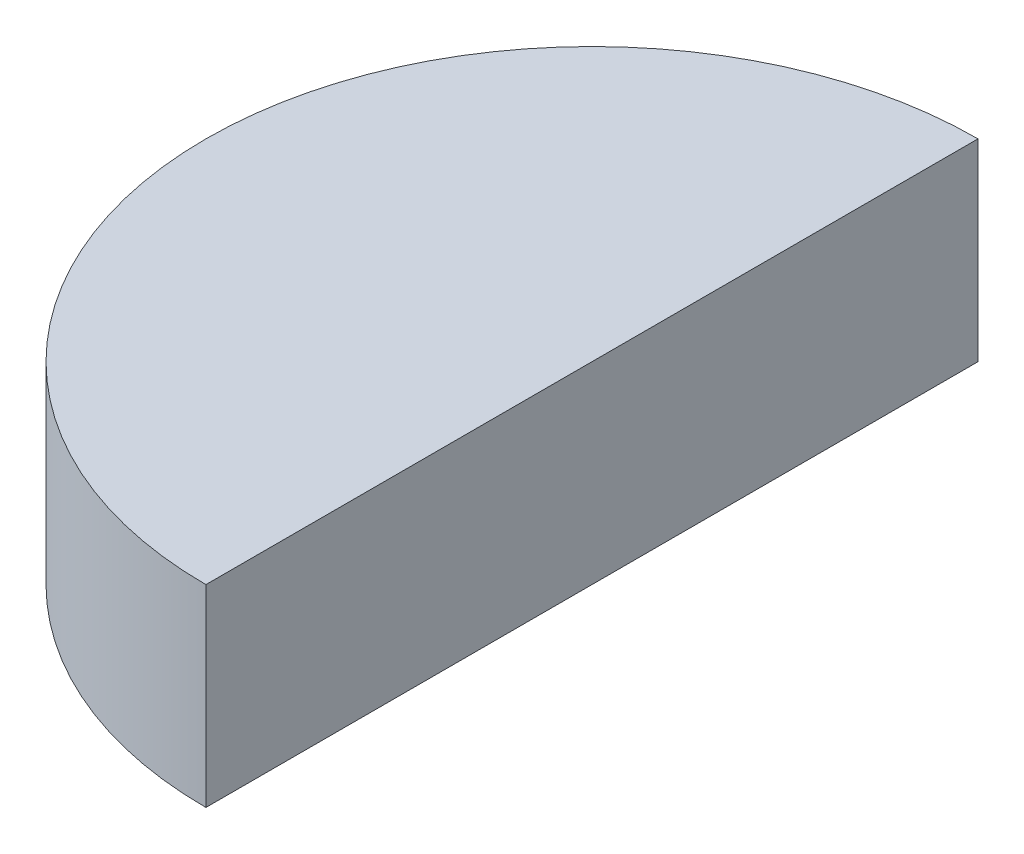
ISO-10303-21;
HEADER;
FILE_DESCRIPTION(('STEP AP214'),'2;1');
FILE_NAME('part.step','',(''),(''),'','','');
FILE_SCHEMA(('AUTOMOTIVE_DESIGN { 1 0 10303 214 1 1 1 1 }'));
ENDSEC;
DATA;
#1=APPLICATION_CONTEXT('core data for automotive mechanical design processes');
#2=APPLICATION_PROTOCOL_DEFINITION('international standard','automotive_design',2000,#1);
#3=PRODUCT_CONTEXT('',#1,'mechanical');
#4=PRODUCT('Part','Part','',(#3));
#5=PRODUCT_RELATED_PRODUCT_CATEGORY('part','',(#4));
#6=PRODUCT_DEFINITION_FORMATION('','',#4);
#7=PRODUCT_DEFINITION_CONTEXT('part definition',#1,'design');
#8=PRODUCT_DEFINITION('design','',#6,#7);
#9=PRODUCT_DEFINITION_SHAPE('','',#8);
#10=(LENGTH_UNIT() NAMED_UNIT(*) SI_UNIT(.MILLI.,.METRE.));
#11=(NAMED_UNIT(*) PLANE_ANGLE_UNIT() SI_UNIT($,.RADIAN.));
#12=(NAMED_UNIT(*) SI_UNIT($,.STERADIAN.) SOLID_ANGLE_UNIT());
#13=UNCERTAINTY_MEASURE_WITH_UNIT(LENGTH_MEASURE(1.E-05),#10,'distance_accuracy_value','');
#14=(GEOMETRIC_REPRESENTATION_CONTEXT(3) GLOBAL_UNCERTAINTY_ASSIGNED_CONTEXT((#13)) GLOBAL_UNIT_ASSIGNED_CONTEXT((#10,
#11,#12)) REPRESENTATION_CONTEXT('',''));
#15=CARTESIAN_POINT('',(0.,0.,0.));
#16=DIRECTION('',(0.,0.,1.));
#17=DIRECTION('',(1.,0.,0.));
#18=AXIS2_PLACEMENT_3D('',#15,#16,#17);
#19=CARTESIAN_POINT('',(0.,5000.,0.));
#20=DIRECTION('',(0.,1.,0.));
#21=DIRECTION('',(0.,0.,1.));
#22=AXIS2_PLACEMENT_3D('',#19,#20,#21);
#23=PLANE('',#22);
#24=CARTESIAN_POINT('',(0.,5000.,0.));
#25=DIRECTION('',(0.,-1.,0.));
#26=DIRECTION('',(0.,0.,-1.));
#27=AXIS2_PLACEMENT_3D('',#24,#25,#26);
#28=CIRCLE('',#27,10000.);
#29=CARTESIAN_POINT('',(6.98296267768627E-11,5000.,10000.));
#30=VERTEX_POINT('',#29);
#31=CARTESIAN_POINT('',(0.,5000.,-10000.));
#32=VERTEX_POINT('',#31);
#33=EDGE_CURVE('E11',#30,#32,#28,.T.);
#34=ORIENTED_EDGE('',*,*,#33,.F.);
#35=DIRECTION('',(0.,0.,-1.));
#36=VECTOR('',#35,1.);
#37=CARTESIAN_POINT('',(0.,5000.,0.));
#38=LINE('',#37,#36);
#39=EDGE_CURVE('E76',#30,#32,#38,.T.);
#40=ORIENTED_EDGE('',*,*,#39,.T.);
#41=EDGE_LOOP('',(#34,#40));
#42=FACE_BOUND('',#41,.T.);
#43=ADVANCED_FACE('F39',(#42),#23,.T.);
#44=CARTESIAN_POINT('',(0.,0.,0.));
#45=DIRECTION('',(0.,-1.,0.));
#46=DIRECTION('',(0.,0.,-1.));
#47=AXIS2_PLACEMENT_3D('',#44,#45,#46);
#48=CYLINDRICAL_SURFACE('',#47,10000.);
#49=CARTESIAN_POINT('',(0.,0.,0.));
#50=DIRECTION('',(0.,-1.,0.));
#51=DIRECTION('',(0.,0.,-1.));
#52=AXIS2_PLACEMENT_3D('',#49,#50,#51);
#53=CIRCLE('',#52,10000.);
#54=CARTESIAN_POINT('',(6.98296267768627E-11,0.,10000.));
#55=VERTEX_POINT('',#54);
#56=CARTESIAN_POINT('',(0.,0.,-10000.));
#57=VERTEX_POINT('',#56);
#58=EDGE_CURVE('E47',#55,#57,#53,.T.);
#59=ORIENTED_EDGE('',*,*,#58,.F.);
#60=DIRECTION('',(0.,1.,0.));
#61=VECTOR('',#60,1.);
#62=CARTESIAN_POINT('',(6.98296267768627E-11,0.,10000.));
#63=LINE('',#62,#61);
#64=EDGE_CURVE('E70',#55,#30,#63,.T.);
#65=ORIENTED_EDGE('',*,*,#64,.T.);
#66=ORIENTED_EDGE('',*,*,#33,.T.);
#67=DIRECTION('',(0.,1.,0.));
#68=VECTOR('',#67,1.);
#69=CARTESIAN_POINT('',(0.,0.,-10000.));
#70=LINE('',#69,#68);
#71=EDGE_CURVE('E69',#57,#32,#70,.T.);
#72=ORIENTED_EDGE('',*,*,#71,.F.);
#73=EDGE_LOOP('',(#59,#65,#66,#72));
#74=FACE_BOUND('',#73,.T.);
#75=ADVANCED_FACE('F77',(#74),#48,.T.);
#76=CARTESIAN_POINT('',(0.,0.,0.));
#77=DIRECTION('',(0.,-1.,0.));
#78=DIRECTION('',(0.,0.,-1.));
#79=AXIS2_PLACEMENT_3D('',#76,#77,#78);
#80=PLANE('',#79);
#81=DIRECTION('',(0.,0.,1.));
#82=VECTOR('',#81,1.);
#83=CARTESIAN_POINT('',(0.,0.,0.));
#84=LINE('',#83,#82);
#85=EDGE_CURVE('E66',#57,#55,#84,.T.);
#86=ORIENTED_EDGE('',*,*,#85,.T.);
#87=ORIENTED_EDGE('',*,*,#58,.T.);
#88=EDGE_LOOP('',(#86,#87));
#89=FACE_BOUND('',#88,.T.);
#90=ADVANCED_FACE('F74',(#89),#80,.T.);
#91=CARTESIAN_POINT('',(0.,0.,0.));
#92=DIRECTION('',(1.,0.,0.));
#93=DIRECTION('',(0.,0.,-1.));
#94=AXIS2_PLACEMENT_3D('',#91,#92,#93);
#95=PLANE('',#94);
#96=ORIENTED_EDGE('',*,*,#85,.F.);
#97=ORIENTED_EDGE('',*,*,#71,.T.);
#98=ORIENTED_EDGE('',*,*,#39,.F.);
#99=ORIENTED_EDGE('',*,*,#64,.F.);
#100=EDGE_LOOP('',(#96,#97,#98,#99));
#101=FACE_BOUND('',#100,.T.);
#102=ADVANCED_FACE('F67',(#101),#95,.T.);
#103=CLOSED_SHELL('',(#43,#75,#90,#102));
#104=MANIFOLD_SOLID_BREP('B2',#103);
#105=ADVANCED_BREP_SHAPE_REPRESENTATION('',(#18,#104),#14);
#106=SHAPE_DEFINITION_REPRESENTATION(#9,#105);
ENDSEC;
END-ISO-10303-21;
